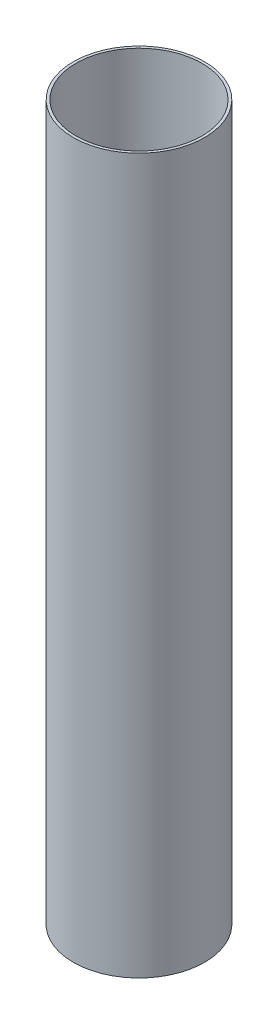
ISO-10303-21;
HEADER;
FILE_DESCRIPTION(('STEP AP214'),'2;1');
FILE_NAME('part.step','',(''),(''),'','','');
FILE_SCHEMA(('AUTOMOTIVE_DESIGN { 1 0 10303 214 1 1 1 1 }'));
ENDSEC;
DATA;
#1=APPLICATION_CONTEXT('core data for automotive mechanical design processes');
#2=APPLICATION_PROTOCOL_DEFINITION('international standard','automotive_design',2000,#1);
#3=PRODUCT_CONTEXT('',#1,'mechanical');
#4=PRODUCT('Part','Part','',(#3));
#5=PRODUCT_RELATED_PRODUCT_CATEGORY('part','',(#4));
#6=PRODUCT_DEFINITION_FORMATION('','',#4);
#7=PRODUCT_DEFINITION_CONTEXT('part definition',#1,'design');
#8=PRODUCT_DEFINITION('design','',#6,#7);
#9=PRODUCT_DEFINITION_SHAPE('','',#8);
#10=(LENGTH_UNIT() NAMED_UNIT(*) SI_UNIT(.MILLI.,.METRE.));
#11=(NAMED_UNIT(*) PLANE_ANGLE_UNIT() SI_UNIT($,.RADIAN.));
#12=(NAMED_UNIT(*) SI_UNIT($,.STERADIAN.) SOLID_ANGLE_UNIT());
#13=UNCERTAINTY_MEASURE_WITH_UNIT(LENGTH_MEASURE(1.E-05),#10,'distance_accuracy_value','');
#14=(GEOMETRIC_REPRESENTATION_CONTEXT(3) GLOBAL_UNCERTAINTY_ASSIGNED_CONTEXT((#13)) GLOBAL_UNIT_ASSIGNED_CONTEXT((#10,
#11,#12)) REPRESENTATION_CONTEXT('',''));
#15=CARTESIAN_POINT('',(0.,0.,0.));
#16=DIRECTION('',(0.,0.,1.));
#17=DIRECTION('',(1.,0.,0.));
#18=AXIS2_PLACEMENT_3D('',#15,#16,#17);
#19=CARTESIAN_POINT('',(0.,431.8,0.));
#20=DIRECTION('',(0.,1.,0.));
#21=DIRECTION('',(0.,0.,1.));
#22=AXIS2_PLACEMENT_3D('',#19,#20,#21);
#23=PLANE('',#22);
#24=CARTESIAN_POINT('',(0.,431.8,0.));
#25=DIRECTION('',(0.,1.,0.));
#26=DIRECTION('',(0.,0.,1.));
#27=AXIS2_PLACEMENT_3D('',#24,#25,#26);
#28=CIRCLE('',#27,39.7);
#29=CARTESIAN_POINT('',(0.,431.8,39.7));
#30=VERTEX_POINT('',#29);
#31=EDGE_CURVE('E10',#30,#30,#28,.T.);
#32=ORIENTED_EDGE('',*,*,#31,.T.);
#33=EDGE_LOOP('',(#32));
#34=FACE_BOUND('',#33,.T.);
#35=CARTESIAN_POINT('',(0.,431.8,0.));
#36=DIRECTION('',(0.,1.,0.));
#37=DIRECTION('',(0.,0.,1.));
#38=AXIS2_PLACEMENT_3D('',#35,#36,#37);
#39=CIRCLE('',#38,38.1);
#40=CARTESIAN_POINT('',(0.,431.8,38.1));
#41=VERTEX_POINT('',#40);
#42=EDGE_CURVE('E42',#41,#41,#39,.T.);
#43=ORIENTED_EDGE('',*,*,#42,.F.);
#44=EDGE_LOOP('',(#43));
#45=FACE_BOUND('',#44,.T.);
#46=ADVANCED_FACE('F31',(#34,#45),#23,.T.);
#47=CARTESIAN_POINT('',(0.,0.,0.));
#48=DIRECTION('',(0.,1.,0.));
#49=DIRECTION('',(0.,0.,1.));
#50=AXIS2_PLACEMENT_3D('',#47,#48,#49);
#51=PLANE('',#50);
#52=CARTESIAN_POINT('',(0.,0.,0.));
#53=DIRECTION('',(0.,1.,0.));
#54=DIRECTION('',(0.,0.,1.));
#55=AXIS2_PLACEMENT_3D('',#52,#53,#54);
#56=CIRCLE('',#55,39.7);
#57=CARTESIAN_POINT('',(0.,0.,39.7));
#58=VERTEX_POINT('',#57);
#59=EDGE_CURVE('E35',#58,#58,#56,.T.);
#60=ORIENTED_EDGE('',*,*,#59,.F.);
#61=EDGE_LOOP('',(#60));
#62=FACE_BOUND('',#61,.T.);
#63=CARTESIAN_POINT('',(0.,0.,0.));
#64=DIRECTION('',(0.,1.,0.));
#65=DIRECTION('',(0.,0.,1.));
#66=AXIS2_PLACEMENT_3D('',#63,#64,#65);
#67=CIRCLE('',#66,38.1);
#68=CARTESIAN_POINT('',(0.,0.,38.1));
#69=VERTEX_POINT('',#68);
#70=EDGE_CURVE('E44',#69,#69,#67,.T.);
#71=ORIENTED_EDGE('',*,*,#70,.T.);
#72=EDGE_LOOP('',(#71));
#73=FACE_BOUND('',#72,.T.);
#74=ADVANCED_FACE('F54',(#62,#73),#51,.F.);
#75=CARTESIAN_POINT('',(0.,431.8,0.));
#76=DIRECTION('',(0.,-1.,0.));
#77=DIRECTION('',(0.,0.,-1.));
#78=AXIS2_PLACEMENT_3D('',#75,#76,#77);
#79=CYLINDRICAL_SURFACE('',#78,39.7);
#80=ORIENTED_EDGE('',*,*,#31,.F.);
#81=EDGE_LOOP('',(#80));
#82=FACE_BOUND('',#81,.T.);
#83=ORIENTED_EDGE('',*,*,#59,.T.);
#84=EDGE_LOOP('',(#83));
#85=FACE_BOUND('',#84,.T.);
#86=ADVANCED_FACE('F33',(#82,#85),#79,.T.);
#87=CARTESIAN_POINT('',(0.,431.8,0.));
#88=DIRECTION('',(0.,-1.,0.));
#89=DIRECTION('',(0.,0.,-1.));
#90=AXIS2_PLACEMENT_3D('',#87,#88,#89);
#91=CYLINDRICAL_SURFACE('',#90,38.1);
#92=ORIENTED_EDGE('',*,*,#42,.T.);
#93=EDGE_LOOP('',(#92));
#94=FACE_BOUND('',#93,.T.);
#95=ORIENTED_EDGE('',*,*,#70,.F.);
#96=EDGE_LOOP('',(#95));
#97=FACE_BOUND('',#96,.T.);
#98=ADVANCED_FACE('F50',(#94,#97),#91,.F.);
#99=CLOSED_SHELL('',(#46,#74,#86,#98));
#100=MANIFOLD_SOLID_BREP('B2',#99);
#101=ADVANCED_BREP_SHAPE_REPRESENTATION('',(#18,#100),#14);
#102=SHAPE_DEFINITION_REPRESENTATION(#9,#101);
ENDSEC;
END-ISO-10303-21;
